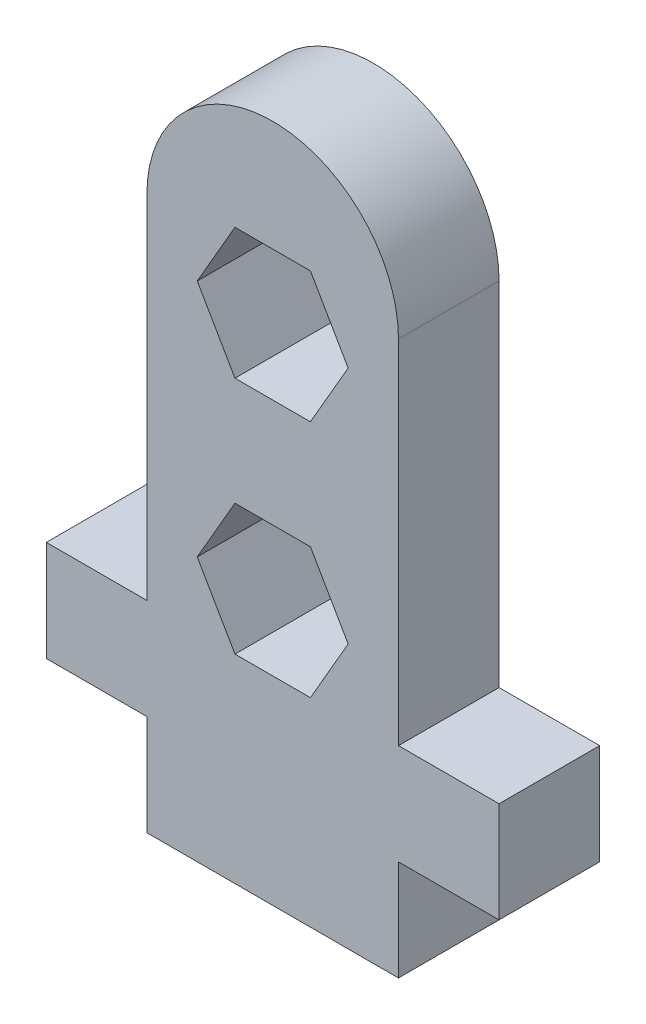
ISO-10303-21;
HEADER;
FILE_DESCRIPTION(('STEP AP214'),'2;1');
FILE_NAME('part.step','',(''),(''),'','','');
FILE_SCHEMA(('AUTOMOTIVE_DESIGN { 1 0 10303 214 1 1 1 1 }'));
ENDSEC;
DATA;
#1=APPLICATION_CONTEXT('core data for automotive mechanical design processes');
#2=APPLICATION_PROTOCOL_DEFINITION('international standard','automotive_design',2000,#1);
#3=PRODUCT_CONTEXT('',#1,'mechanical');
#4=PRODUCT('Part','Part','',(#3));
#5=PRODUCT_RELATED_PRODUCT_CATEGORY('part','',(#4));
#6=PRODUCT_DEFINITION_FORMATION('','',#4);
#7=PRODUCT_DEFINITION_CONTEXT('part definition',#1,'design');
#8=PRODUCT_DEFINITION('design','',#6,#7);
#9=PRODUCT_DEFINITION_SHAPE('','',#8);
#10=(LENGTH_UNIT() NAMED_UNIT(*) SI_UNIT(.MILLI.,.METRE.));
#11=(NAMED_UNIT(*) PLANE_ANGLE_UNIT() SI_UNIT($,.RADIAN.));
#12=(NAMED_UNIT(*) SI_UNIT($,.STERADIAN.) SOLID_ANGLE_UNIT());
#13=UNCERTAINTY_MEASURE_WITH_UNIT(LENGTH_MEASURE(1.E-05),#10,'distance_accuracy_value','');
#14=(GEOMETRIC_REPRESENTATION_CONTEXT(3) GLOBAL_UNCERTAINTY_ASSIGNED_CONTEXT((#13)) GLOBAL_UNIT_ASSIGNED_CONTEXT((#10,
#11,#12)) REPRESENTATION_CONTEXT('',''));
#15=CARTESIAN_POINT('',(0.,0.,0.));
#16=DIRECTION('',(0.,0.,1.));
#17=DIRECTION('',(1.,0.,0.));
#18=AXIS2_PLACEMENT_3D('',#15,#16,#17);
#19=CARTESIAN_POINT('',(5.,22.,4.));
#20=DIRECTION('',(0.,0.,1.));
#21=DIRECTION('',(1.,0.,0.));
#22=AXIS2_PLACEMENT_3D('',#19,#20,#21);
#23=PLANE('',#22);
#24=DIRECTION('',(-0.5,-0.866025403784438,0.));
#25=VECTOR('',#24,1.);
#26=CARTESIAN_POINT('',(3.5,22.5980762113533,4.));
#27=LINE('',#26,#25);
#28=CARTESIAN_POINT('',(3.5,22.5980762113533,4.));
#29=VERTEX_POINT('',#28);
#30=CARTESIAN_POINT('',(1.99999999999999,20.,4.));
#31=VERTEX_POINT('',#30);
#32=EDGE_CURVE('E246',#29,#31,#27,.T.);
#33=ORIENTED_EDGE('',*,*,#32,.F.);
#34=DIRECTION('',(-1.,0.,0.));
#35=VECTOR('',#34,1.);
#36=CARTESIAN_POINT('',(6.5,22.5980762113533,4.));
#37=LINE('',#36,#35);
#38=CARTESIAN_POINT('',(6.5,22.5980762113533,4.));
#39=VERTEX_POINT('',#38);
#40=EDGE_CURVE('E244',#39,#29,#37,.T.);
#41=ORIENTED_EDGE('',*,*,#40,.F.);
#42=DIRECTION('',(-0.5,0.866025403784438,0.));
#43=VECTOR('',#42,1.);
#44=CARTESIAN_POINT('',(8.00000000000001,20.,4.));
#45=LINE('',#44,#43);
#46=CARTESIAN_POINT('',(8.00000000000001,20.,4.));
#47=VERTEX_POINT('',#46);
#48=EDGE_CURVE('E256',#47,#39,#45,.T.);
#49=ORIENTED_EDGE('',*,*,#48,.F.);
#50=DIRECTION('',(0.499999999999999,0.866025403784439,0.));
#51=VECTOR('',#50,1.);
#52=CARTESIAN_POINT('',(6.50000000000001,17.4019237886467,4.));
#53=LINE('',#52,#51);
#54=CARTESIAN_POINT('',(6.50000000000001,17.4019237886467,4.));
#55=VERTEX_POINT('',#54);
#56=EDGE_CURVE('E253',#55,#47,#53,.T.);
#57=ORIENTED_EDGE('',*,*,#56,.F.);
#58=DIRECTION('',(1.,0.,0.));
#59=VECTOR('',#58,1.);
#60=CARTESIAN_POINT('',(3.5,17.4019237886467,4.));
#61=LINE('',#60,#59);
#62=CARTESIAN_POINT('',(3.5,17.4019237886467,4.));
#63=VERTEX_POINT('',#62);
#64=EDGE_CURVE('E251',#63,#55,#61,.T.);
#65=ORIENTED_EDGE('',*,*,#64,.F.);
#66=DIRECTION('',(0.5,-0.866025403784439,0.));
#67=VECTOR('',#66,1.);
#68=CARTESIAN_POINT('',(1.99999999999999,20.,4.));
#69=LINE('',#68,#67);
#70=EDGE_CURVE('E249',#31,#63,#69,.T.);
#71=ORIENTED_EDGE('',*,*,#70,.F.);
#72=EDGE_LOOP('',(#33,#41,#49,#57,#65,#71));
#73=FACE_BOUND('',#72,.T.);
#74=DIRECTION('',(0.,-1.,0.));
#75=VECTOR('',#74,1.);
#76=CARTESIAN_POINT('',(0.,0.,4.));
#77=LINE('',#76,#75);
#78=CARTESIAN_POINT('',(0.,4.,4.));
#79=VERTEX_POINT('',#78);
#80=CARTESIAN_POINT('',(0.,0.,4.));
#81=VERTEX_POINT('',#80);
#82=EDGE_CURVE('E289',#79,#81,#77,.T.);
#83=ORIENTED_EDGE('',*,*,#82,.T.);
#84=DIRECTION('',(1.,0.,0.));
#85=VECTOR('',#84,1.);
#86=CARTESIAN_POINT('',(0.,0.,4.));
#87=LINE('',#86,#85);
#88=CARTESIAN_POINT('',(10.,0.,4.));
#89=VERTEX_POINT('',#88);
#90=EDGE_CURVE('E292',#81,#89,#87,.T.);
#91=ORIENTED_EDGE('',*,*,#90,.T.);
#92=DIRECTION('',(0.,1.,0.));
#93=VECTOR('',#92,1.);
#94=CARTESIAN_POINT('',(10.,0.,4.));
#95=LINE('',#94,#93);
#96=CARTESIAN_POINT('',(10.,4.,4.));
#97=VERTEX_POINT('',#96);
#98=EDGE_CURVE('E295',#89,#97,#95,.T.);
#99=ORIENTED_EDGE('',*,*,#98,.T.);
#100=DIRECTION('',(1.,0.,0.));
#101=VECTOR('',#100,1.);
#102=CARTESIAN_POINT('',(10.,4.,4.));
#103=LINE('',#102,#101);
#104=CARTESIAN_POINT('',(14.,4.,4.));
#105=VERTEX_POINT('',#104);
#106=EDGE_CURVE('E297',#97,#105,#103,.T.);
#107=ORIENTED_EDGE('',*,*,#106,.T.);
#108=DIRECTION('',(0.,1.,0.));
#109=VECTOR('',#108,1.);
#110=CARTESIAN_POINT('',(14.,4.,4.));
#111=LINE('',#110,#109);
#112=CARTESIAN_POINT('',(14.,8.,4.));
#113=VERTEX_POINT('',#112);
#114=EDGE_CURVE('E299',#105,#113,#111,.T.);
#115=ORIENTED_EDGE('',*,*,#114,.T.);
#116=DIRECTION('',(-1.,0.,0.));
#117=VECTOR('',#116,1.);
#118=CARTESIAN_POINT('',(14.,8.,4.));
#119=LINE('',#118,#117);
#120=CARTESIAN_POINT('',(10.,8.,4.));
#121=VERTEX_POINT('',#120);
#122=EDGE_CURVE('E301',#113,#121,#119,.T.);
#123=ORIENTED_EDGE('',*,*,#122,.T.);
#124=DIRECTION('',(0.,1.,0.));
#125=VECTOR('',#124,1.);
#126=CARTESIAN_POINT('',(10.,8.,4.));
#127=LINE('',#126,#125);
#128=CARTESIAN_POINT('',(10.,22.,4.));
#129=VERTEX_POINT('',#128);
#130=EDGE_CURVE('E303',#121,#129,#127,.T.);
#131=ORIENTED_EDGE('',*,*,#130,.T.);
#132=CARTESIAN_POINT('',(5.,22.,4.));
#133=DIRECTION('',(0.,0.,1.));
#134=DIRECTION('',(1.,0.,0.));
#135=AXIS2_PLACEMENT_3D('',#132,#133,#134);
#136=CIRCLE('',#135,5.);
#137=CARTESIAN_POINT('',(0.,22.,4.));
#138=VERTEX_POINT('',#137);
#139=EDGE_CURVE('E305',#129,#138,#136,.T.);
#140=ORIENTED_EDGE('',*,*,#139,.T.);
#141=DIRECTION('',(0.,-1.,0.));
#142=VECTOR('',#141,1.);
#143=CARTESIAN_POINT('',(0.,8.,4.));
#144=LINE('',#143,#142);
#145=CARTESIAN_POINT('',(0.,8.,4.));
#146=VERTEX_POINT('',#145);
#147=EDGE_CURVE('E307',#138,#146,#144,.T.);
#148=ORIENTED_EDGE('',*,*,#147,.T.);
#149=DIRECTION('',(-1.,0.,0.));
#150=VECTOR('',#149,1.);
#151=CARTESIAN_POINT('',(-4.,8.,4.));
#152=LINE('',#151,#150);
#153=CARTESIAN_POINT('',(-4.,8.,4.));
#154=VERTEX_POINT('',#153);
#155=EDGE_CURVE('E309',#146,#154,#152,.T.);
#156=ORIENTED_EDGE('',*,*,#155,.T.);
#157=DIRECTION('',(0.,-1.,0.));
#158=VECTOR('',#157,1.);
#159=CARTESIAN_POINT('',(-4.,4.,4.));
#160=LINE('',#159,#158);
#161=CARTESIAN_POINT('',(-4.,4.,4.));
#162=VERTEX_POINT('',#161);
#163=EDGE_CURVE('E311',#154,#162,#160,.T.);
#164=ORIENTED_EDGE('',*,*,#163,.T.);
#165=DIRECTION('',(1.,0.,0.));
#166=VECTOR('',#165,1.);
#167=CARTESIAN_POINT('',(0.,4.,4.));
#168=LINE('',#167,#166);
#169=EDGE_CURVE('E313',#162,#79,#168,.T.);
#170=ORIENTED_EDGE('',*,*,#169,.T.);
#171=EDGE_LOOP('',(#83,#91,#99,#107,#115,#123,#131,#140,#148,#156,#164,#170));
#172=FACE_BOUND('',#171,.T.);
#173=DIRECTION('',(-0.5,-0.866025403784438,0.));
#174=VECTOR('',#173,1.);
#175=CARTESIAN_POINT('',(3.5,13.0980762113533,4.));
#176=LINE('',#175,#174);
#177=CARTESIAN_POINT('',(3.5,13.0980762113533,4.));
#178=VERTEX_POINT('',#177);
#179=CARTESIAN_POINT('',(1.99999999999999,10.5,4.));
#180=VERTEX_POINT('',#179);
#181=EDGE_CURVE('E201',#178,#180,#176,.T.);
#182=ORIENTED_EDGE('',*,*,#181,.F.);
#183=DIRECTION('',(-1.,0.,0.));
#184=VECTOR('',#183,1.);
#185=CARTESIAN_POINT('',(6.5,13.0980762113533,4.));
#186=LINE('',#185,#184);
#187=CARTESIAN_POINT('',(6.5,13.0980762113533,4.));
#188=VERTEX_POINT('',#187);
#189=EDGE_CURVE('E193',#188,#178,#186,.T.);
#190=ORIENTED_EDGE('',*,*,#189,.F.);
#191=DIRECTION('',(-0.5,0.866025403784439,0.));
#192=VECTOR('',#191,1.);
#193=CARTESIAN_POINT('',(8.00000000000001,10.5,4.));
#194=LINE('',#193,#192);
#195=CARTESIAN_POINT('',(8.00000000000001,10.5,4.));
#196=VERTEX_POINT('',#195);
#197=EDGE_CURVE('E222',#196,#188,#194,.T.);
#198=ORIENTED_EDGE('',*,*,#197,.F.);
#199=DIRECTION('',(0.5,0.866025403784439,0.));
#200=VECTOR('',#199,1.);
#201=CARTESIAN_POINT('',(6.5,7.90192378864668,4.));
#202=LINE('',#201,#200);
#203=CARTESIAN_POINT('',(6.5,7.90192378864668,4.));
#204=VERTEX_POINT('',#203);
#205=EDGE_CURVE('E220',#204,#196,#202,.T.);
#206=ORIENTED_EDGE('',*,*,#205,.F.);
#207=DIRECTION('',(1.,0.,0.));
#208=VECTOR('',#207,1.);
#209=CARTESIAN_POINT('',(3.5,7.90192378864668,4.));
#210=LINE('',#209,#208);
#211=CARTESIAN_POINT('',(3.5,7.90192378864668,4.));
#212=VERTEX_POINT('',#211);
#213=EDGE_CURVE('E216',#212,#204,#210,.T.);
#214=ORIENTED_EDGE('',*,*,#213,.F.);
#215=DIRECTION('',(0.5,-0.866025403784439,0.));
#216=VECTOR('',#215,1.);
#217=CARTESIAN_POINT('',(1.99999999999999,10.5,4.));
#218=LINE('',#217,#216);
#219=EDGE_CURVE('E214',#180,#212,#218,.T.);
#220=ORIENTED_EDGE('',*,*,#219,.F.);
#221=EDGE_LOOP('',(#182,#190,#198,#206,#214,#220));
#222=FACE_BOUND('',#221,.T.);
#223=ADVANCED_FACE('F32',(#73,#172,#222),#23,.T.);
#224=CARTESIAN_POINT('',(5.,22.,0.));
#225=DIRECTION('',(0.,0.,1.));
#226=DIRECTION('',(1.,0.,0.));
#227=AXIS2_PLACEMENT_3D('',#224,#225,#226);
#228=PLANE('',#227);
#229=DIRECTION('',(-1.,0.,0.));
#230=VECTOR('',#229,1.);
#231=CARTESIAN_POINT('',(6.5,22.5980762113533,0.));
#232=LINE('',#231,#230);
#233=CARTESIAN_POINT('',(6.5,22.5980762113533,0.));
#234=VERTEX_POINT('',#233);
#235=CARTESIAN_POINT('',(3.5,22.5980762113533,0.));
#236=VERTEX_POINT('',#235);
#237=EDGE_CURVE('E209',#234,#236,#232,.T.);
#238=ORIENTED_EDGE('',*,*,#237,.T.);
#239=DIRECTION('',(-0.5,-0.866025403784438,0.));
#240=VECTOR('',#239,1.);
#241=CARTESIAN_POINT('',(3.5,22.5980762113533,0.));
#242=LINE('',#241,#240);
#243=CARTESIAN_POINT('',(1.99999999999999,20.,0.));
#244=VERTEX_POINT('',#243);
#245=EDGE_CURVE('E261',#236,#244,#242,.T.);
#246=ORIENTED_EDGE('',*,*,#245,.T.);
#247=DIRECTION('',(0.5,-0.866025403784439,0.));
#248=VECTOR('',#247,1.);
#249=CARTESIAN_POINT('',(1.99999999999999,20.,0.));
#250=LINE('',#249,#248);
#251=CARTESIAN_POINT('',(3.5,17.4019237886467,0.));
#252=VERTEX_POINT('',#251);
#253=EDGE_CURVE('E264',#244,#252,#250,.T.);
#254=ORIENTED_EDGE('',*,*,#253,.T.);
#255=DIRECTION('',(1.,0.,0.));
#256=VECTOR('',#255,1.);
#257=CARTESIAN_POINT('',(3.5,17.4019237886467,0.));
#258=LINE('',#257,#256);
#259=CARTESIAN_POINT('',(6.50000000000001,17.4019237886467,0.));
#260=VERTEX_POINT('',#259);
#261=EDGE_CURVE('E267',#252,#260,#258,.T.);
#262=ORIENTED_EDGE('',*,*,#261,.T.);
#263=DIRECTION('',(0.499999999999999,0.866025403784439,0.));
#264=VECTOR('',#263,1.);
#265=CARTESIAN_POINT('',(6.50000000000001,17.4019237886467,0.));
#266=LINE('',#265,#264);
#267=CARTESIAN_POINT('',(8.00000000000001,20.,0.));
#268=VERTEX_POINT('',#267);
#269=EDGE_CURVE('E270',#260,#268,#266,.T.);
#270=ORIENTED_EDGE('',*,*,#269,.T.);
#271=DIRECTION('',(-0.5,0.866025403784438,0.));
#272=VECTOR('',#271,1.);
#273=CARTESIAN_POINT('',(8.00000000000001,20.,0.));
#274=LINE('',#273,#272);
#275=EDGE_CURVE('E247',#268,#234,#274,.T.);
#276=ORIENTED_EDGE('',*,*,#275,.T.);
#277=EDGE_LOOP('',(#238,#246,#254,#262,#270,#276));
#278=FACE_BOUND('',#277,.T.);
#279=DIRECTION('',(0.,-1.,0.));
#280=VECTOR('',#279,1.);
#281=CARTESIAN_POINT('',(0.,0.,0.));
#282=LINE('',#281,#280);
#283=CARTESIAN_POINT('',(0.,4.,0.));
#284=VERTEX_POINT('',#283);
#285=CARTESIAN_POINT('',(0.,0.,0.));
#286=VERTEX_POINT('',#285);
#287=EDGE_CURVE('E288',#284,#286,#282,.T.);
#288=ORIENTED_EDGE('',*,*,#287,.F.);
#289=DIRECTION('',(1.,0.,0.));
#290=VECTOR('',#289,1.);
#291=CARTESIAN_POINT('',(0.,4.,0.));
#292=LINE('',#291,#290);
#293=CARTESIAN_POINT('',(-4.,4.,0.));
#294=VERTEX_POINT('',#293);
#295=EDGE_CURVE('E293',#294,#284,#292,.T.);
#296=ORIENTED_EDGE('',*,*,#295,.F.);
#297=DIRECTION('',(0.,-1.,0.));
#298=VECTOR('',#297,1.);
#299=CARTESIAN_POINT('',(-4.,4.,0.));
#300=LINE('',#299,#298);
#301=CARTESIAN_POINT('',(-4.,8.,0.));
#302=VERTEX_POINT('',#301);
#303=EDGE_CURVE('E336',#302,#294,#300,.T.);
#304=ORIENTED_EDGE('',*,*,#303,.F.);
#305=DIRECTION('',(-1.,0.,0.));
#306=VECTOR('',#305,1.);
#307=CARTESIAN_POINT('',(-4.,8.,0.));
#308=LINE('',#307,#306);
#309=CARTESIAN_POINT('',(0.,8.,0.));
#310=VERTEX_POINT('',#309);
#311=EDGE_CURVE('E334',#310,#302,#308,.T.);
#312=ORIENTED_EDGE('',*,*,#311,.F.);
#313=DIRECTION('',(0.,-1.,0.));
#314=VECTOR('',#313,1.);
#315=CARTESIAN_POINT('',(0.,8.,0.));
#316=LINE('',#315,#314);
#317=CARTESIAN_POINT('',(0.,22.,0.));
#318=VERTEX_POINT('',#317);
#319=EDGE_CURVE('E332',#318,#310,#316,.T.);
#320=ORIENTED_EDGE('',*,*,#319,.F.);
#321=CARTESIAN_POINT('',(5.,22.,0.));
#322=DIRECTION('',(0.,0.,1.));
#323=DIRECTION('',(1.,0.,0.));
#324=AXIS2_PLACEMENT_3D('',#321,#322,#323);
#325=CIRCLE('',#324,5.);
#326=CARTESIAN_POINT('',(10.,22.,0.));
#327=VERTEX_POINT('',#326);
#328=EDGE_CURVE('E330',#327,#318,#325,.T.);
#329=ORIENTED_EDGE('',*,*,#328,.F.);
#330=DIRECTION('',(0.,1.,0.));
#331=VECTOR('',#330,1.);
#332=CARTESIAN_POINT('',(10.,8.,0.));
#333=LINE('',#332,#331);
#334=CARTESIAN_POINT('',(10.,8.,0.));
#335=VERTEX_POINT('',#334);
#336=EDGE_CURVE('E328',#335,#327,#333,.T.);
#337=ORIENTED_EDGE('',*,*,#336,.F.);
#338=DIRECTION('',(-1.,0.,0.));
#339=VECTOR('',#338,1.);
#340=CARTESIAN_POINT('',(14.,8.,0.));
#341=LINE('',#340,#339);
#342=CARTESIAN_POINT('',(14.,8.,0.));
#343=VERTEX_POINT('',#342);
#344=EDGE_CURVE('E326',#343,#335,#341,.T.);
#345=ORIENTED_EDGE('',*,*,#344,.F.);
#346=DIRECTION('',(0.,1.,0.));
#347=VECTOR('',#346,1.);
#348=CARTESIAN_POINT('',(14.,4.,0.));
#349=LINE('',#348,#347);
#350=CARTESIAN_POINT('',(14.,4.,0.));
#351=VERTEX_POINT('',#350);
#352=EDGE_CURVE('E324',#351,#343,#349,.T.);
#353=ORIENTED_EDGE('',*,*,#352,.F.);
#354=DIRECTION('',(1.,0.,0.));
#355=VECTOR('',#354,1.);
#356=CARTESIAN_POINT('',(10.,4.,0.));
#357=LINE('',#356,#355);
#358=CARTESIAN_POINT('',(10.,4.,0.));
#359=VERTEX_POINT('',#358);
#360=EDGE_CURVE('E322',#359,#351,#357,.T.);
#361=ORIENTED_EDGE('',*,*,#360,.F.);
#362=DIRECTION('',(0.,1.,0.));
#363=VECTOR('',#362,1.);
#364=CARTESIAN_POINT('',(10.,0.,0.));
#365=LINE('',#364,#363);
#366=CARTESIAN_POINT('',(10.,0.,0.));
#367=VERTEX_POINT('',#366);
#368=EDGE_CURVE('E320',#367,#359,#365,.T.);
#369=ORIENTED_EDGE('',*,*,#368,.F.);
#370=DIRECTION('',(1.,0.,0.));
#371=VECTOR('',#370,1.);
#372=CARTESIAN_POINT('',(0.,0.,0.));
#373=LINE('',#372,#371);
#374=EDGE_CURVE('E318',#286,#367,#373,.T.);
#375=ORIENTED_EDGE('',*,*,#374,.F.);
#376=EDGE_LOOP('',(#288,#296,#304,#312,#320,#329,#337,#345,#353,#361,#369,#375));
#377=FACE_BOUND('',#376,.T.);
#378=DIRECTION('',(-1.,0.,0.));
#379=VECTOR('',#378,1.);
#380=CARTESIAN_POINT('',(6.5,13.0980762113533,0.));
#381=LINE('',#380,#379);
#382=CARTESIAN_POINT('',(6.5,13.0980762113533,0.));
#383=VERTEX_POINT('',#382);
#384=CARTESIAN_POINT('',(3.5,13.0980762113533,0.));
#385=VERTEX_POINT('',#384);
#386=EDGE_CURVE('E55',#383,#385,#381,.T.);
#387=ORIENTED_EDGE('',*,*,#386,.T.);
#388=DIRECTION('',(-0.5,-0.866025403784438,0.));
#389=VECTOR('',#388,1.);
#390=CARTESIAN_POINT('',(3.5,13.0980762113533,0.));
#391=LINE('',#390,#389);
#392=CARTESIAN_POINT('',(1.99999999999999,10.5,0.));
#393=VERTEX_POINT('',#392);
#394=EDGE_CURVE('E208',#385,#393,#391,.T.);
#395=ORIENTED_EDGE('',*,*,#394,.T.);
#396=DIRECTION('',(0.5,-0.866025403784439,0.));
#397=VECTOR('',#396,1.);
#398=CARTESIAN_POINT('',(1.99999999999999,10.5,0.));
#399=LINE('',#398,#397);
#400=CARTESIAN_POINT('',(3.5,7.90192378864668,0.));
#401=VERTEX_POINT('',#400);
#402=EDGE_CURVE('E226',#393,#401,#399,.T.);
#403=ORIENTED_EDGE('',*,*,#402,.T.);
#404=DIRECTION('',(1.,0.,0.));
#405=VECTOR('',#404,1.);
#406=CARTESIAN_POINT('',(3.5,7.90192378864668,0.));
#407=LINE('',#406,#405);
#408=CARTESIAN_POINT('',(6.5,7.90192378864668,0.));
#409=VERTEX_POINT('',#408);
#410=EDGE_CURVE('E229',#401,#409,#407,.T.);
#411=ORIENTED_EDGE('',*,*,#410,.T.);
#412=DIRECTION('',(0.5,0.866025403784439,0.));
#413=VECTOR('',#412,1.);
#414=CARTESIAN_POINT('',(6.5,7.90192378864668,0.));
#415=LINE('',#414,#413);
#416=CARTESIAN_POINT('',(8.00000000000001,10.5,0.));
#417=VERTEX_POINT('',#416);
#418=EDGE_CURVE('E232',#409,#417,#415,.T.);
#419=ORIENTED_EDGE('',*,*,#418,.T.);
#420=DIRECTION('',(-0.5,0.866025403784439,0.));
#421=VECTOR('',#420,1.);
#422=CARTESIAN_POINT('',(8.00000000000001,10.5,0.));
#423=LINE('',#422,#421);
#424=EDGE_CURVE('E202',#417,#383,#423,.T.);
#425=ORIENTED_EDGE('',*,*,#424,.T.);
#426=EDGE_LOOP('',(#387,#395,#403,#411,#419,#425));
#427=FACE_BOUND('',#426,.T.);
#428=ADVANCED_FACE('F378',(#278,#377,#427),#228,.F.);
#429=CARTESIAN_POINT('',(0.,0.,4.));
#430=DIRECTION('',(1.,0.,0.));
#431=DIRECTION('',(0.,0.,-1.));
#432=AXIS2_PLACEMENT_3D('',#429,#430,#431);
#433=PLANE('',#432);
#434=ORIENTED_EDGE('',*,*,#287,.T.);
#435=DIRECTION('',(0.,0.,-1.));
#436=VECTOR('',#435,1.);
#437=CARTESIAN_POINT('',(0.,0.,4.));
#438=LINE('',#437,#436);
#439=EDGE_CURVE('E11',#81,#286,#438,.T.);
#440=ORIENTED_EDGE('',*,*,#439,.F.);
#441=ORIENTED_EDGE('',*,*,#82,.F.);
#442=DIRECTION('',(0.,0.,-1.));
#443=VECTOR('',#442,1.);
#444=CARTESIAN_POINT('',(0.,4.,4.));
#445=LINE('',#444,#443);
#446=EDGE_CURVE('E315',#79,#284,#445,.T.);
#447=ORIENTED_EDGE('',*,*,#446,.T.);
#448=EDGE_LOOP('',(#434,#440,#441,#447));
#449=FACE_BOUND('',#448,.T.);
#450=ADVANCED_FACE('F34',(#449),#433,.F.);
#451=CARTESIAN_POINT('',(0.,0.,4.));
#452=DIRECTION('',(0.,1.,0.));
#453=DIRECTION('',(0.,0.,1.));
#454=AXIS2_PLACEMENT_3D('',#451,#452,#453);
#455=PLANE('',#454);
#456=ORIENTED_EDGE('',*,*,#374,.T.);
#457=DIRECTION('',(0.,0.,-1.));
#458=VECTOR('',#457,1.);
#459=CARTESIAN_POINT('',(10.,0.,4.));
#460=LINE('',#459,#458);
#461=EDGE_CURVE('E40',#89,#367,#460,.T.);
#462=ORIENTED_EDGE('',*,*,#461,.F.);
#463=ORIENTED_EDGE('',*,*,#90,.F.);
#464=ORIENTED_EDGE('',*,*,#439,.T.);
#465=EDGE_LOOP('',(#456,#462,#463,#464));
#466=FACE_BOUND('',#465,.T.);
#467=ADVANCED_FACE('F395',(#466),#455,.F.);
#468=CARTESIAN_POINT('',(10.,0.,4.));
#469=DIRECTION('',(-1.,0.,0.));
#470=DIRECTION('',(0.,0.,1.));
#471=AXIS2_PLACEMENT_3D('',#468,#469,#470);
#472=PLANE('',#471);
#473=ORIENTED_EDGE('',*,*,#368,.T.);
#474=DIRECTION('',(0.,0.,-1.));
#475=VECTOR('',#474,1.);
#476=CARTESIAN_POINT('',(10.,4.,4.));
#477=LINE('',#476,#475);
#478=EDGE_CURVE('E365',#97,#359,#477,.T.);
#479=ORIENTED_EDGE('',*,*,#478,.F.);
#480=ORIENTED_EDGE('',*,*,#98,.F.);
#481=ORIENTED_EDGE('',*,*,#461,.T.);
#482=EDGE_LOOP('',(#473,#479,#480,#481));
#483=FACE_BOUND('',#482,.T.);
#484=ADVANCED_FACE('F372',(#483),#472,.F.);
#485=CARTESIAN_POINT('',(10.,4.,4.));
#486=DIRECTION('',(0.,1.,0.));
#487=DIRECTION('',(-1.,0.,0.));
#488=AXIS2_PLACEMENT_3D('',#485,#486,#487);
#489=PLANE('',#488);
#490=ORIENTED_EDGE('',*,*,#360,.T.);
#491=DIRECTION('',(0.,0.,-1.));
#492=VECTOR('',#491,1.);
#493=CARTESIAN_POINT('',(14.,4.,4.));
#494=LINE('',#493,#492);
#495=EDGE_CURVE('E362',#105,#351,#494,.T.);
#496=ORIENTED_EDGE('',*,*,#495,.F.);
#497=ORIENTED_EDGE('',*,*,#106,.F.);
#498=ORIENTED_EDGE('',*,*,#478,.T.);
#499=EDGE_LOOP('',(#490,#496,#497,#498));
#500=FACE_BOUND('',#499,.T.);
#501=ADVANCED_FACE('F384',(#500),#489,.F.);
#502=CARTESIAN_POINT('',(14.,4.,4.));
#503=DIRECTION('',(-1.,0.,0.));
#504=DIRECTION('',(0.,0.,1.));
#505=AXIS2_PLACEMENT_3D('',#502,#503,#504);
#506=PLANE('',#505);
#507=ORIENTED_EDGE('',*,*,#352,.T.);
#508=DIRECTION('',(0.,0.,-1.));
#509=VECTOR('',#508,1.);
#510=CARTESIAN_POINT('',(14.,8.,4.));
#511=LINE('',#510,#509);
#512=EDGE_CURVE('E359',#113,#343,#511,.T.);
#513=ORIENTED_EDGE('',*,*,#512,.F.);
#514=ORIENTED_EDGE('',*,*,#114,.F.);
#515=ORIENTED_EDGE('',*,*,#495,.T.);
#516=EDGE_LOOP('',(#507,#513,#514,#515));
#517=FACE_BOUND('',#516,.T.);
#518=ADVANCED_FACE('F388',(#517),#506,.F.);
#519=CARTESIAN_POINT('',(14.,8.,4.));
#520=DIRECTION('',(0.,-1.,0.));
#521=DIRECTION('',(0.,0.,-1.));
#522=AXIS2_PLACEMENT_3D('',#519,#520,#521);
#523=PLANE('',#522);
#524=ORIENTED_EDGE('',*,*,#344,.T.);
#525=DIRECTION('',(0.,0.,-1.));
#526=VECTOR('',#525,1.);
#527=CARTESIAN_POINT('',(10.,8.,4.));
#528=LINE('',#527,#526);
#529=EDGE_CURVE('E356',#121,#335,#528,.T.);
#530=ORIENTED_EDGE('',*,*,#529,.F.);
#531=ORIENTED_EDGE('',*,*,#122,.F.);
#532=ORIENTED_EDGE('',*,*,#512,.T.);
#533=EDGE_LOOP('',(#524,#530,#531,#532));
#534=FACE_BOUND('',#533,.T.);
#535=ADVANCED_FACE('F428',(#534),#523,.F.);
#536=CARTESIAN_POINT('',(10.,8.,4.));
#537=DIRECTION('',(-1.,0.,0.));
#538=DIRECTION('',(0.,0.,1.));
#539=AXIS2_PLACEMENT_3D('',#536,#537,#538);
#540=PLANE('',#539);
#541=ORIENTED_EDGE('',*,*,#336,.T.);
#542=DIRECTION('',(0.,0.,-1.));
#543=VECTOR('',#542,1.);
#544=CARTESIAN_POINT('',(10.,22.,4.));
#545=LINE('',#544,#543);
#546=EDGE_CURVE('E353',#129,#327,#545,.T.);
#547=ORIENTED_EDGE('',*,*,#546,.F.);
#548=ORIENTED_EDGE('',*,*,#130,.F.);
#549=ORIENTED_EDGE('',*,*,#529,.T.);
#550=EDGE_LOOP('',(#541,#547,#548,#549));
#551=FACE_BOUND('',#550,.T.);
#552=ADVANCED_FACE('F426',(#551),#540,.F.);
#553=CARTESIAN_POINT('',(5.,22.,4.));
#554=DIRECTION('',(0.,0.,-1.));
#555=DIRECTION('',(-1.,0.,0.));
#556=AXIS2_PLACEMENT_3D('',#553,#554,#555);
#557=CYLINDRICAL_SURFACE('',#556,5.);
#558=ORIENTED_EDGE('',*,*,#328,.T.);
#559=DIRECTION('',(0.,0.,-1.));
#560=VECTOR('',#559,1.);
#561=CARTESIAN_POINT('',(0.,22.,4.));
#562=LINE('',#561,#560);
#563=EDGE_CURVE('E350',#138,#318,#562,.T.);
#564=ORIENTED_EDGE('',*,*,#563,.F.);
#565=ORIENTED_EDGE('',*,*,#139,.F.);
#566=ORIENTED_EDGE('',*,*,#546,.T.);
#567=EDGE_LOOP('',(#558,#564,#565,#566));
#568=FACE_BOUND('',#567,.T.);
#569=ADVANCED_FACE('F422',(#568),#557,.T.);
#570=CARTESIAN_POINT('',(0.,8.,4.));
#571=DIRECTION('',(1.,0.,0.));
#572=DIRECTION('',(0.,0.,-1.));
#573=AXIS2_PLACEMENT_3D('',#570,#571,#572);
#574=PLANE('',#573);
#575=ORIENTED_EDGE('',*,*,#319,.T.);
#576=DIRECTION('',(0.,0.,-1.));
#577=VECTOR('',#576,1.);
#578=CARTESIAN_POINT('',(0.,8.,4.));
#579=LINE('',#578,#577);
#580=EDGE_CURVE('E347',#146,#310,#579,.T.);
#581=ORIENTED_EDGE('',*,*,#580,.F.);
#582=ORIENTED_EDGE('',*,*,#147,.F.);
#583=ORIENTED_EDGE('',*,*,#563,.T.);
#584=EDGE_LOOP('',(#575,#581,#582,#583));
#585=FACE_BOUND('',#584,.T.);
#586=ADVANCED_FACE('F417',(#585),#574,.F.);
#587=CARTESIAN_POINT('',(-4.,8.,4.));
#588=DIRECTION('',(0.,-1.,0.));
#589=DIRECTION('',(1.,0.,0.));
#590=AXIS2_PLACEMENT_3D('',#587,#588,#589);
#591=PLANE('',#590);
#592=ORIENTED_EDGE('',*,*,#311,.T.);
#593=DIRECTION('',(0.,0.,-1.));
#594=VECTOR('',#593,1.);
#595=CARTESIAN_POINT('',(-4.,8.,4.));
#596=LINE('',#595,#594);
#597=EDGE_CURVE('E344',#154,#302,#596,.T.);
#598=ORIENTED_EDGE('',*,*,#597,.F.);
#599=ORIENTED_EDGE('',*,*,#155,.F.);
#600=ORIENTED_EDGE('',*,*,#580,.T.);
#601=EDGE_LOOP('',(#592,#598,#599,#600));
#602=FACE_BOUND('',#601,.T.);
#603=ADVANCED_FACE('F411',(#602),#591,.F.);
#604=CARTESIAN_POINT('',(-4.,4.,4.));
#605=DIRECTION('',(1.,0.,0.));
#606=DIRECTION('',(0.,0.,-1.));
#607=AXIS2_PLACEMENT_3D('',#604,#605,#606);
#608=PLANE('',#607);
#609=ORIENTED_EDGE('',*,*,#303,.T.);
#610=DIRECTION('',(0.,0.,-1.));
#611=VECTOR('',#610,1.);
#612=CARTESIAN_POINT('',(-4.,4.,4.));
#613=LINE('',#612,#611);
#614=EDGE_CURVE('E341',#162,#294,#613,.T.);
#615=ORIENTED_EDGE('',*,*,#614,.F.);
#616=ORIENTED_EDGE('',*,*,#163,.F.);
#617=ORIENTED_EDGE('',*,*,#597,.T.);
#618=EDGE_LOOP('',(#609,#615,#616,#617));
#619=FACE_BOUND('',#618,.T.);
#620=ADVANCED_FACE('F407',(#619),#608,.F.);
#621=CARTESIAN_POINT('',(0.,4.,4.));
#622=DIRECTION('',(0.,1.,0.));
#623=DIRECTION('',(-1.,0.,0.));
#624=AXIS2_PLACEMENT_3D('',#621,#622,#623);
#625=PLANE('',#624);
#626=ORIENTED_EDGE('',*,*,#295,.T.);
#627=ORIENTED_EDGE('',*,*,#446,.F.);
#628=ORIENTED_EDGE('',*,*,#169,.F.);
#629=ORIENTED_EDGE('',*,*,#614,.T.);
#630=EDGE_LOOP('',(#626,#627,#628,#629));
#631=FACE_BOUND('',#630,.T.);
#632=ADVANCED_FACE('F402',(#631),#625,.F.);
#633=CARTESIAN_POINT('',(6.5,22.5980762113533,4.));
#634=DIRECTION('',(0.,-1.,0.));
#635=DIRECTION('',(0.,0.,-1.));
#636=AXIS2_PLACEMENT_3D('',#633,#634,#635);
#637=PLANE('',#636);
#638=ORIENTED_EDGE('',*,*,#237,.F.);
#639=DIRECTION('',(0.,0.,-1.));
#640=VECTOR('',#639,1.);
#641=CARTESIAN_POINT('',(6.5,22.5980762113533,4.));
#642=LINE('',#641,#640);
#643=EDGE_CURVE('E258',#39,#234,#642,.T.);
#644=ORIENTED_EDGE('',*,*,#643,.F.);
#645=ORIENTED_EDGE('',*,*,#40,.T.);
#646=DIRECTION('',(0.,0.,-1.));
#647=VECTOR('',#646,1.);
#648=CARTESIAN_POINT('',(3.5,22.5980762113533,4.));
#649=LINE('',#648,#647);
#650=EDGE_CURVE('E285',#29,#236,#649,.T.);
#651=ORIENTED_EDGE('',*,*,#650,.T.);
#652=EDGE_LOOP('',(#638,#644,#645,#651));
#653=FACE_BOUND('',#652,.T.);
#654=ADVANCED_FACE('F447',(#653),#637,.T.);
#655=CARTESIAN_POINT('',(3.5,22.5980762113533,4.));
#656=DIRECTION('',(0.866025403784439,-0.5,0.));
#657=DIRECTION('',(0.5,0.866025403784439,0.));
#658=AXIS2_PLACEMENT_3D('',#655,#656,#657);
#659=PLANE('',#658);
#660=ORIENTED_EDGE('',*,*,#245,.F.);
#661=ORIENTED_EDGE('',*,*,#650,.F.);
#662=ORIENTED_EDGE('',*,*,#32,.T.);
#663=DIRECTION('',(0.,0.,-1.));
#664=VECTOR('',#663,1.);
#665=CARTESIAN_POINT('',(1.99999999999999,20.,4.));
#666=LINE('',#665,#664);
#667=EDGE_CURVE('E283',#31,#244,#666,.T.);
#668=ORIENTED_EDGE('',*,*,#667,.T.);
#669=EDGE_LOOP('',(#660,#661,#662,#668));
#670=FACE_BOUND('',#669,.T.);
#671=ADVANCED_FACE('F485',(#670),#659,.T.);
#672=CARTESIAN_POINT('',(1.99999999999999,20.,4.));
#673=DIRECTION('',(0.866025403784439,0.5,0.));
#674=DIRECTION('',(-0.5,0.866025403784439,0.));
#675=AXIS2_PLACEMENT_3D('',#672,#673,#674);
#676=PLANE('',#675);
#677=ORIENTED_EDGE('',*,*,#253,.F.);
#678=ORIENTED_EDGE('',*,*,#667,.F.);
#679=ORIENTED_EDGE('',*,*,#70,.T.);
#680=DIRECTION('',(0.,0.,-1.));
#681=VECTOR('',#680,1.);
#682=CARTESIAN_POINT('',(3.5,17.4019237886467,4.));
#683=LINE('',#682,#681);
#684=EDGE_CURVE('E281',#63,#252,#683,.T.);
#685=ORIENTED_EDGE('',*,*,#684,.T.);
#686=EDGE_LOOP('',(#677,#678,#679,#685));
#687=FACE_BOUND('',#686,.T.);
#688=ADVANCED_FACE('F492',(#687),#676,.T.);
#689=CARTESIAN_POINT('',(3.5,17.4019237886467,4.));
#690=DIRECTION('',(0.,1.,0.));
#691=DIRECTION('',(-1.,0.,0.));
#692=AXIS2_PLACEMENT_3D('',#689,#690,#691);
#693=PLANE('',#692);
#694=ORIENTED_EDGE('',*,*,#261,.F.);
#695=ORIENTED_EDGE('',*,*,#684,.F.);
#696=ORIENTED_EDGE('',*,*,#64,.T.);
#697=DIRECTION('',(0.,0.,-1.));
#698=VECTOR('',#697,1.);
#699=CARTESIAN_POINT('',(6.50000000000001,17.4019237886467,4.));
#700=LINE('',#699,#698);
#701=EDGE_CURVE('E279',#55,#260,#700,.T.);
#702=ORIENTED_EDGE('',*,*,#701,.T.);
#703=EDGE_LOOP('',(#694,#695,#696,#702));
#704=FACE_BOUND('',#703,.T.);
#705=ADVANCED_FACE('F499',(#704),#693,.T.);
#706=CARTESIAN_POINT('',(6.50000000000001,17.4019237886467,4.));
#707=DIRECTION('',(-0.866025403784439,0.499999999999999,0.));
#708=DIRECTION('',(-0.499999999999999,-0.866025403784439,0.));
#709=AXIS2_PLACEMENT_3D('',#706,#707,#708);
#710=PLANE('',#709);
#711=ORIENTED_EDGE('',*,*,#269,.F.);
#712=ORIENTED_EDGE('',*,*,#701,.F.);
#713=ORIENTED_EDGE('',*,*,#56,.T.);
#714=DIRECTION('',(0.,0.,-1.));
#715=VECTOR('',#714,1.);
#716=CARTESIAN_POINT('',(8.00000000000001,20.,4.));
#717=LINE('',#716,#715);
#718=EDGE_CURVE('E277',#47,#268,#717,.T.);
#719=ORIENTED_EDGE('',*,*,#718,.T.);
#720=EDGE_LOOP('',(#711,#712,#713,#719));
#721=FACE_BOUND('',#720,.T.);
#722=ADVANCED_FACE('F507',(#721),#710,.T.);
#723=CARTESIAN_POINT('',(8.00000000000001,20.,4.));
#724=DIRECTION('',(-0.866025403784438,-0.5,0.));
#725=DIRECTION('',(0.5,-0.866025403784438,0.));
#726=AXIS2_PLACEMENT_3D('',#723,#724,#725);
#727=PLANE('',#726);
#728=ORIENTED_EDGE('',*,*,#275,.F.);
#729=ORIENTED_EDGE('',*,*,#718,.F.);
#730=ORIENTED_EDGE('',*,*,#48,.T.);
#731=ORIENTED_EDGE('',*,*,#643,.T.);
#732=EDGE_LOOP('',(#728,#729,#730,#731));
#733=FACE_BOUND('',#732,.T.);
#734=ADVANCED_FACE('F515',(#733),#727,.T.);
#735=CARTESIAN_POINT('',(6.5,13.0980762113533,4.));
#736=DIRECTION('',(0.,-1.,0.));
#737=DIRECTION('',(0.,0.,-1.));
#738=AXIS2_PLACEMENT_3D('',#735,#736,#737);
#739=PLANE('',#738);
#740=ORIENTED_EDGE('',*,*,#386,.F.);
#741=DIRECTION('',(0.,0.,-1.));
#742=VECTOR('',#741,1.);
#743=CARTESIAN_POINT('',(6.5,13.0980762113533,4.));
#744=LINE('',#743,#742);
#745=EDGE_CURVE('E197',#188,#383,#744,.T.);
#746=ORIENTED_EDGE('',*,*,#745,.F.);
#747=ORIENTED_EDGE('',*,*,#189,.T.);
#748=DIRECTION('',(0.,0.,-1.));
#749=VECTOR('',#748,1.);
#750=CARTESIAN_POINT('',(3.5,13.0980762113533,4.));
#751=LINE('',#750,#749);
#752=EDGE_CURVE('E196',#178,#385,#751,.T.);
#753=ORIENTED_EDGE('',*,*,#752,.T.);
#754=EDGE_LOOP('',(#740,#746,#747,#753));
#755=FACE_BOUND('',#754,.T.);
#756=ADVANCED_FACE('F195',(#755),#739,.T.);
#757=CARTESIAN_POINT('',(3.5,13.0980762113533,4.));
#758=DIRECTION('',(0.866025403784439,-0.5,0.));
#759=DIRECTION('',(0.5,0.866025403784439,0.));
#760=AXIS2_PLACEMENT_3D('',#757,#758,#759);
#761=PLANE('',#760);
#762=ORIENTED_EDGE('',*,*,#394,.F.);
#763=ORIENTED_EDGE('',*,*,#752,.F.);
#764=ORIENTED_EDGE('',*,*,#181,.T.);
#765=DIRECTION('',(0.,0.,-1.));
#766=VECTOR('',#765,1.);
#767=CARTESIAN_POINT('',(1.99999999999999,10.5,4.));
#768=LINE('',#767,#766);
#769=EDGE_CURVE('E210',#180,#393,#768,.T.);
#770=ORIENTED_EDGE('',*,*,#769,.T.);
#771=EDGE_LOOP('',(#762,#763,#764,#770));
#772=FACE_BOUND('',#771,.T.);
#773=ADVANCED_FACE('F205',(#772),#761,.T.);
#774=CARTESIAN_POINT('',(1.99999999999999,10.5,4.));
#775=DIRECTION('',(0.866025403784439,0.5,0.));
#776=DIRECTION('',(-0.5,0.866025403784439,0.));
#777=AXIS2_PLACEMENT_3D('',#774,#775,#776);
#778=PLANE('',#777);
#779=ORIENTED_EDGE('',*,*,#402,.F.);
#780=ORIENTED_EDGE('',*,*,#769,.F.);
#781=ORIENTED_EDGE('',*,*,#219,.T.);
#782=DIRECTION('',(0.,0.,-1.));
#783=VECTOR('',#782,1.);
#784=CARTESIAN_POINT('',(3.5,7.90192378864668,4.));
#785=LINE('',#784,#783);
#786=EDGE_CURVE('E241',#212,#401,#785,.T.);
#787=ORIENTED_EDGE('',*,*,#786,.T.);
#788=EDGE_LOOP('',(#779,#780,#781,#787));
#789=FACE_BOUND('',#788,.T.);
#790=ADVANCED_FACE('F536',(#789),#778,.T.);
#791=CARTESIAN_POINT('',(3.5,7.90192378864668,4.));
#792=DIRECTION('',(0.,1.,0.));
#793=DIRECTION('',(0.,0.,1.));
#794=AXIS2_PLACEMENT_3D('',#791,#792,#793);
#795=PLANE('',#794);
#796=ORIENTED_EDGE('',*,*,#410,.F.);
#797=ORIENTED_EDGE('',*,*,#786,.F.);
#798=ORIENTED_EDGE('',*,*,#213,.T.);
#799=DIRECTION('',(0.,0.,-1.));
#800=VECTOR('',#799,1.);
#801=CARTESIAN_POINT('',(6.5,7.90192378864668,4.));
#802=LINE('',#801,#800);
#803=EDGE_CURVE('E239',#204,#409,#802,.T.);
#804=ORIENTED_EDGE('',*,*,#803,.T.);
#805=EDGE_LOOP('',(#796,#797,#798,#804));
#806=FACE_BOUND('',#805,.T.);
#807=ADVANCED_FACE('F543',(#806),#795,.T.);
#808=CARTESIAN_POINT('',(6.5,7.90192378864668,4.));
#809=DIRECTION('',(-0.866025403784439,0.5,0.));
#810=DIRECTION('',(-0.5,-0.866025403784439,0.));
#811=AXIS2_PLACEMENT_3D('',#808,#809,#810);
#812=PLANE('',#811);
#813=ORIENTED_EDGE('',*,*,#418,.F.);
#814=ORIENTED_EDGE('',*,*,#803,.F.);
#815=ORIENTED_EDGE('',*,*,#205,.T.);
#816=DIRECTION('',(0.,0.,-1.));
#817=VECTOR('',#816,1.);
#818=CARTESIAN_POINT('',(8.00000000000001,10.5,4.));
#819=LINE('',#818,#817);
#820=EDGE_CURVE('E47',#196,#417,#819,.T.);
#821=ORIENTED_EDGE('',*,*,#820,.T.);
#822=EDGE_LOOP('',(#813,#814,#815,#821));
#823=FACE_BOUND('',#822,.T.);
#824=ADVANCED_FACE('F551',(#823),#812,.T.);
#825=CARTESIAN_POINT('',(8.00000000000001,10.5,4.));
#826=DIRECTION('',(-0.866025403784439,-0.5,0.));
#827=DIRECTION('',(0.5,-0.866025403784439,0.));
#828=AXIS2_PLACEMENT_3D('',#825,#826,#827);
#829=PLANE('',#828);
#830=ORIENTED_EDGE('',*,*,#424,.F.);
#831=ORIENTED_EDGE('',*,*,#820,.F.);
#832=ORIENTED_EDGE('',*,*,#197,.T.);
#833=ORIENTED_EDGE('',*,*,#745,.T.);
#834=EDGE_LOOP('',(#830,#831,#832,#833));
#835=FACE_BOUND('',#834,.T.);
#836=ADVANCED_FACE('F559',(#835),#829,.T.);
#837=CLOSED_SHELL('',(#223,#428,#450,#467,#484,#501,#518,#535,#552,#569,#586,#603,#620,#632,
#654,#671,#688,#705,#722,#734,#756,#773,#790,#807,#824,#836));
#838=MANIFOLD_SOLID_BREP('B2',#837);
#839=ADVANCED_BREP_SHAPE_REPRESENTATION('',(#18,#838),#14);
#840=SHAPE_DEFINITION_REPRESENTATION(#9,#839);
ENDSEC;
END-ISO-10303-21;
